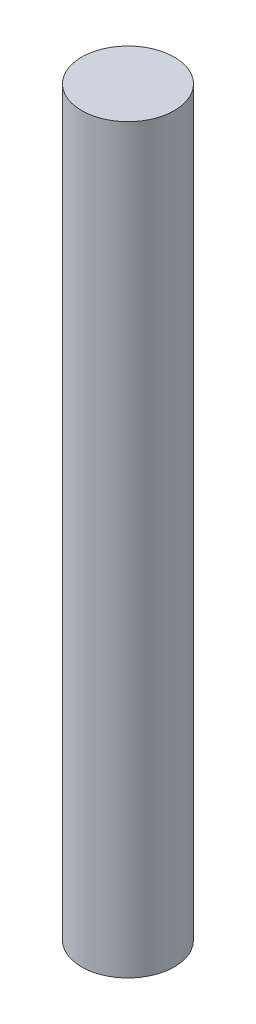
ISO-10303-21;
HEADER;
FILE_DESCRIPTION(('STEP AP214'),'2;1');
FILE_NAME('part.step','',(''),(''),'','','');
FILE_SCHEMA(('AUTOMOTIVE_DESIGN { 1 0 10303 214 1 1 1 1 }'));
ENDSEC;
DATA;
#1=APPLICATION_CONTEXT('core data for automotive mechanical design processes');
#2=APPLICATION_PROTOCOL_DEFINITION('international standard','automotive_design',2000,#1);
#3=PRODUCT_CONTEXT('',#1,'mechanical');
#4=PRODUCT('Part','Part','',(#3));
#5=PRODUCT_RELATED_PRODUCT_CATEGORY('part','',(#4));
#6=PRODUCT_DEFINITION_FORMATION('','',#4);
#7=PRODUCT_DEFINITION_CONTEXT('part definition',#1,'design');
#8=PRODUCT_DEFINITION('design','',#6,#7);
#9=PRODUCT_DEFINITION_SHAPE('','',#8);
#10=(LENGTH_UNIT() NAMED_UNIT(*) SI_UNIT(.MILLI.,.METRE.));
#11=(NAMED_UNIT(*) PLANE_ANGLE_UNIT() SI_UNIT($,.RADIAN.));
#12=(NAMED_UNIT(*) SI_UNIT($,.STERADIAN.) SOLID_ANGLE_UNIT());
#13=UNCERTAINTY_MEASURE_WITH_UNIT(LENGTH_MEASURE(1.E-05),#10,'distance_accuracy_value','');
#14=(GEOMETRIC_REPRESENTATION_CONTEXT(3) GLOBAL_UNCERTAINTY_ASSIGNED_CONTEXT((#13)) GLOBAL_UNIT_ASSIGNED_CONTEXT((#10,
#11,#12)) REPRESENTATION_CONTEXT('',''));
#15=CARTESIAN_POINT('',(0.,0.,0.));
#16=DIRECTION('',(0.,0.,1.));
#17=DIRECTION('',(1.,0.,0.));
#18=AXIS2_PLACEMENT_3D('',#15,#16,#17);
#19=CARTESIAN_POINT('',(0.,101.6,0.));
#20=DIRECTION('',(0.,-1.,0.));
#21=DIRECTION('',(0.,0.,-1.));
#22=AXIS2_PLACEMENT_3D('',#19,#20,#21);
#23=CYLINDRICAL_SURFACE('',#22,6.35);
#24=CARTESIAN_POINT('',(0.,101.6,0.));
#25=DIRECTION('',(0.,1.,0.));
#26=DIRECTION('',(0.,0.,1.));
#27=AXIS2_PLACEMENT_3D('',#24,#25,#26);
#28=CIRCLE('',#27,6.35);
#29=CARTESIAN_POINT('',(0.,101.6,6.35));
#30=VERTEX_POINT('',#29);
#31=EDGE_CURVE('E10',#30,#30,#28,.T.);
#32=ORIENTED_EDGE('',*,*,#31,.F.);
#33=EDGE_LOOP('',(#32));
#34=FACE_BOUND('',#33,.T.);
#35=CARTESIAN_POINT('',(0.,0.,0.));
#36=DIRECTION('',(0.,1.,0.));
#37=DIRECTION('',(0.,0.,1.));
#38=AXIS2_PLACEMENT_3D('',#35,#36,#37);
#39=CIRCLE('',#38,6.35);
#40=CARTESIAN_POINT('',(0.,0.,6.35));
#41=VERTEX_POINT('',#40);
#42=EDGE_CURVE('E34',#41,#41,#39,.T.);
#43=ORIENTED_EDGE('',*,*,#42,.T.);
#44=EDGE_LOOP('',(#43));
#45=FACE_BOUND('',#44,.T.);
#46=ADVANCED_FACE('F31',(#34,#45),#23,.T.);
#47=CARTESIAN_POINT('',(0.,101.6,0.));
#48=DIRECTION('',(0.,1.,0.));
#49=DIRECTION('',(0.,0.,1.));
#50=AXIS2_PLACEMENT_3D('',#47,#48,#49);
#51=PLANE('',#50);
#52=ORIENTED_EDGE('',*,*,#31,.T.);
#53=EDGE_LOOP('',(#52));
#54=FACE_BOUND('',#53,.T.);
#55=ADVANCED_FACE('F46',(#54),#51,.T.);
#56=CARTESIAN_POINT('',(0.,0.,0.));
#57=DIRECTION('',(0.,1.,0.));
#58=DIRECTION('',(0.,0.,1.));
#59=AXIS2_PLACEMENT_3D('',#56,#57,#58);
#60=PLANE('',#59);
#61=ORIENTED_EDGE('',*,*,#42,.F.);
#62=EDGE_LOOP('',(#61));
#63=FACE_BOUND('',#62,.T.);
#64=ADVANCED_FACE('F44',(#63),#60,.F.);
#65=CLOSED_SHELL('',(#46,#55,#64));
#66=MANIFOLD_SOLID_BREP('B2',#65);
#67=ADVANCED_BREP_SHAPE_REPRESENTATION('',(#18,#66),#14);
#68=SHAPE_DEFINITION_REPRESENTATION(#9,#67);
ENDSEC;
END-ISO-10303-21;
